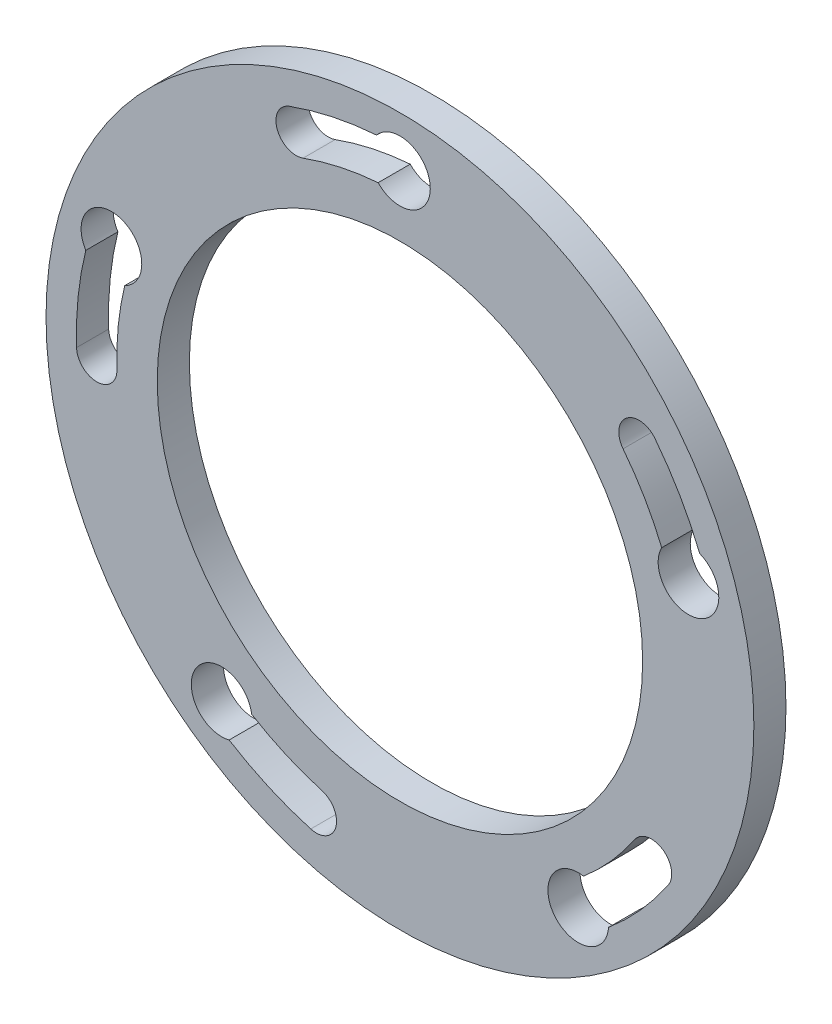
ISO-10303-21;
HEADER;
FILE_DESCRIPTION(('STEP AP214'),'2;1');
FILE_NAME('part.step','',(''),(''),'','','');
FILE_SCHEMA(('AUTOMOTIVE_DESIGN { 1 0 10303 214 1 1 1 1 }'));
ENDSEC;
DATA;
#1=APPLICATION_CONTEXT('core data for automotive mechanical design processes');
#2=APPLICATION_PROTOCOL_DEFINITION('international standard','automotive_design',2000,#1);
#3=PRODUCT_CONTEXT('',#1,'mechanical');
#4=PRODUCT('Part','Part','',(#3));
#5=PRODUCT_RELATED_PRODUCT_CATEGORY('part','',(#4));
#6=PRODUCT_DEFINITION_FORMATION('','',#4);
#7=PRODUCT_DEFINITION_CONTEXT('part definition',#1,'design');
#8=PRODUCT_DEFINITION('design','',#6,#7);
#9=PRODUCT_DEFINITION_SHAPE('','',#8);
#10=(LENGTH_UNIT() NAMED_UNIT(*) SI_UNIT(.MILLI.,.METRE.));
#11=(NAMED_UNIT(*) PLANE_ANGLE_UNIT() SI_UNIT($,.RADIAN.));
#12=(NAMED_UNIT(*) SI_UNIT($,.STERADIAN.) SOLID_ANGLE_UNIT());
#13=UNCERTAINTY_MEASURE_WITH_UNIT(LENGTH_MEASURE(1.E-05),#10,'distance_accuracy_value','');
#14=(GEOMETRIC_REPRESENTATION_CONTEXT(3) GLOBAL_UNCERTAINTY_ASSIGNED_CONTEXT((#13)) GLOBAL_UNIT_ASSIGNED_CONTEXT((#10,
#11,#12)) REPRESENTATION_CONTEXT('',''));
#15=CARTESIAN_POINT('',(0.,0.,0.));
#16=DIRECTION('',(0.,0.,1.));
#17=DIRECTION('',(1.,0.,0.));
#18=AXIS2_PLACEMENT_3D('',#15,#16,#17);
#19=CARTESIAN_POINT('',(0.,0.,3.175));
#20=DIRECTION('',(0.,0.,1.));
#21=DIRECTION('',(1.,0.,0.));
#22=AXIS2_PLACEMENT_3D('',#19,#20,#21);
#23=PLANE('',#22);
#24=CARTESIAN_POINT('',(28.5316954888546,9.27050983124833,3.175));
#25=DIRECTION('',(0.,0.,1.));
#26=DIRECTION('',(1.,0.,0.));
#27=AXIS2_PLACEMENT_3D('',#24,#25,#26);
#28=CIRCLE('',#27,3.00000000000007);
#29=CARTESIAN_POINT('',(25.883271618733,10.6797120893257,3.175));
#30=VERTEX_POINT('',#29);
#31=CARTESIAN_POINT('',(29.641374395643,12.0577329518164,3.175));
#32=VERTEX_POINT('',#31);
#33=EDGE_CURVE('E178',#30,#32,#28,.T.);
#34=ORIENTED_EDGE('',*,*,#33,.F.);
#35=CARTESIAN_POINT('',(0.,0.,3.175));
#36=DIRECTION('',(0.,0.,-1.));
#37=DIRECTION('',(1.,0.,0.));
#38=AXIS2_PLACEMENT_3D('',#35,#36,#37);
#39=CIRCLE('',#38,28.);
#40=CARTESIAN_POINT('',(22.0643011009882,17.2385213091185,3.175));
#41=VERTEX_POINT('',#40);
#42=EDGE_CURVE('E170',#41,#30,#39,.T.);
#43=ORIENTED_EDGE('',*,*,#42,.F.);
#44=CARTESIAN_POINT('',(23.6403226082017,18.4698442597697,3.175));
#45=DIRECTION('',(0.,0.,1.));
#46=DIRECTION('',(1.,0.,0.));
#47=AXIS2_PLACEMENT_3D('',#44,#45,#46);
#48=CIRCLE('',#47,2.);
#49=CARTESIAN_POINT('',(25.2163441154151,19.7011672104211,3.175));
#50=VERTEX_POINT('',#49);
#51=EDGE_CURVE('E193',#50,#41,#48,.T.);
#52=ORIENTED_EDGE('',*,*,#51,.F.);
#53=CARTESIAN_POINT('',(0.,0.,3.175));
#54=DIRECTION('',(0.,0.,1.));
#55=DIRECTION('',(1.,0.,0.));
#56=AXIS2_PLACEMENT_3D('',#53,#54,#55);
#57=CIRCLE('',#56,32.);
#58=EDGE_CURVE('E191',#32,#50,#57,.T.);
#59=ORIENTED_EDGE('',*,*,#58,.F.);
#60=EDGE_LOOP('',(#34,#43,#52,#59));
#61=FACE_BOUND('',#60,.T.);
#62=CARTESIAN_POINT('',(0.,0.,3.175));
#63=DIRECTION('',(0.,0.,1.));
#64=DIRECTION('',(1.,0.,0.));
#65=AXIS2_PLACEMENT_3D('',#62,#63,#64);
#66=CIRCLE('',#65,32.);
#67=CARTESIAN_POINT('',(-16.893018017547,-27.177673599093,3.175));
#68=VERTEX_POINT('',#67);
#69=CARTESIAN_POINT('',(-8.82039538614393,-30.7603742700262,3.175));
#70=VERTEX_POINT('',#69);
#71=EDGE_CURVE('E242',#68,#70,#66,.T.);
#72=ORIENTED_EDGE('',*,*,#71,.F.);
#73=CARTESIAN_POINT('',(-17.6335575687744,-24.2705098312483,3.175));
#74=DIRECTION('',(0.,0.,1.));
#75=DIRECTION('',(1.,0.,0.));
#76=AXIS2_PLACEMENT_3D('',#73,#74,#75);
#77=CIRCLE('',#76,3.0000000000002);
#78=CARTESIAN_POINT('',(-14.6626293447425,-23.8538739138677,3.175));
#79=VERTEX_POINT('',#78);
#80=EDGE_CURVE('E240',#79,#68,#77,.T.);
#81=ORIENTED_EDGE('',*,*,#80,.F.);
#82=CARTESIAN_POINT('',(0.,0.,3.175));
#83=DIRECTION('',(0.,0.,-1.));
#84=DIRECTION('',(1.,0.,0.));
#85=AXIS2_PLACEMENT_3D('',#82,#83,#84);
#86=CIRCLE('',#85,28.);
#87=CARTESIAN_POINT('',(-7.71784596287594,-26.9153274862729,3.175));
#88=VERTEX_POINT('',#87);
#89=EDGE_CURVE('E248',#88,#79,#86,.T.);
#90=ORIENTED_EDGE('',*,*,#89,.F.);
#91=CARTESIAN_POINT('',(-8.26912067451019,-28.8378508781495,3.175));
#92=DIRECTION('',(0.,0.,1.));
#93=DIRECTION('',(1.,0.,0.));
#94=AXIS2_PLACEMENT_3D('',#91,#92,#93);
#95=CIRCLE('',#94,2.);
#96=EDGE_CURVE('E245',#70,#88,#95,.T.);
#97=ORIENTED_EDGE('',*,*,#96,.F.);
#98=EDGE_LOOP('',(#72,#81,#90,#97));
#99=FACE_BOUND('',#98,.T.);
#100=CARTESIAN_POINT('',(0.,0.,3.175));
#101=DIRECTION('',(0.,0.,1.));
#102=DIRECTION('',(1.,0.,0.));
#103=AXIS2_PLACEMENT_3D('',#100,#101,#102);
#104=CIRCLE('',#103,32.);
#105=CARTESIAN_POINT('',(-2.3078970706877,31.9166666666667,3.175));
#106=VERTEX_POINT('',#105);
#107=CARTESIAN_POINT('',(-10.9446445864214,30.0701638651491,3.175));
#108=VERTEX_POINT('',#107);
#109=EDGE_CURVE('E304',#106,#108,#104,.T.);
#110=ORIENTED_EDGE('',*,*,#109,.F.);
#111=CARTESIAN_POINT('',(0.,30.,3.175));
#112=DIRECTION('',(0.,0.,1.));
#113=DIRECTION('',(1.,0.,0.));
#114=AXIS2_PLACEMENT_3D('',#111,#112,#113);
#115=CIRCLE('',#114,3.);
#116=CARTESIAN_POINT('',(-2.1586389744981,27.9166666666667,3.175));
#117=VERTEX_POINT('',#116);
#118=EDGE_CURVE('E302',#117,#106,#115,.T.);
#119=ORIENTED_EDGE('',*,*,#118,.F.);
#120=CARTESIAN_POINT('',(0.,0.,3.175));
#121=DIRECTION('',(0.,0.,-1.));
#122=DIRECTION('',(1.,0.,0.));
#123=AXIS2_PLACEMENT_3D('',#120,#121,#122);
#124=CIRCLE('',#123,28.);
#125=CARTESIAN_POINT('',(-9.57656401311875,26.3113933820054,3.175));
#126=VERTEX_POINT('',#125);
#127=EDGE_CURVE('E310',#126,#117,#124,.T.);
#128=ORIENTED_EDGE('',*,*,#127,.F.);
#129=CARTESIAN_POINT('',(-10.2606042997701,28.1907786235772,3.175));
#130=DIRECTION('',(0.,0.,1.));
#131=DIRECTION('',(1.,0.,0.));
#132=AXIS2_PLACEMENT_3D('',#129,#130,#131);
#133=CIRCLE('',#132,2.);
#134=EDGE_CURVE('E307',#108,#126,#133,.T.);
#135=ORIENTED_EDGE('',*,*,#134,.F.);
#136=EDGE_LOOP('',(#110,#119,#128,#135));
#137=FACE_BOUND('',#136,.T.);
#138=CARTESIAN_POINT('',(0.,0.,3.175));
#139=DIRECTION('',(0.,0.,1.));
#140=DIRECTION('',(1.,0.,0.));
#141=AXIS2_PLACEMENT_3D('',#138,#139,#140);
#142=CIRCLE('',#141,35.);
#143=CARTESIAN_POINT('',(35.,0.,3.175));
#144=VERTEX_POINT('',#143);
#145=EDGE_CURVE('E11',#144,#144,#142,.T.);
#146=ORIENTED_EDGE('',*,*,#145,.T.);
#147=EDGE_LOOP('',(#146));
#148=FACE_BOUND('',#147,.T.);
#149=CARTESIAN_POINT('',(0.,0.,3.175));
#150=DIRECTION('',(0.,0.,1.));
#151=DIRECTION('',(1.,0.,0.));
#152=AXIS2_PLACEMENT_3D('',#149,#150,#151);
#153=CIRCLE('',#152,32.);
#154=CARTESIAN_POINT('',(-31.0677332278643,7.66785185578437,3.175));
#155=VERTEX_POINT('',#154);
#156=CARTESIAN_POINT('',(-31.9805064646111,-1.11678389448004,3.175));
#157=VERTEX_POINT('',#156);
#158=EDGE_CURVE('E273',#155,#157,#153,.T.);
#159=ORIENTED_EDGE('',*,*,#158,.F.);
#160=CARTESIAN_POINT('',(-28.5316954888545,9.27050983124875,3.175));
#161=DIRECTION('',(0.,0.,1.));
#162=DIRECTION('',(1.,0.,0.));
#163=AXIS2_PLACEMENT_3D('',#160,#161,#162);
#164=CIRCLE('',#163,3.00000000000025);
#165=CARTESIAN_POINT('',(-27.2173838744131,6.5737367632755,3.175));
#166=VERTEX_POINT('',#165);
#167=EDGE_CURVE('E271',#166,#155,#164,.T.);
#168=ORIENTED_EDGE('',*,*,#167,.F.);
#169=CARTESIAN_POINT('',(0.,0.,3.175));
#170=DIRECTION('',(0.,0.,-1.));
#171=DIRECTION('',(1.,0.,0.));
#172=AXIS2_PLACEMENT_3D('',#169,#170,#171);
#173=CIRCLE('',#172,28.);
#174=CARTESIAN_POINT('',(-27.9829431565347,-0.977185907670063,3.175));
#175=VERTEX_POINT('',#174);
#176=EDGE_CURVE('E279',#175,#166,#173,.T.);
#177=ORIENTED_EDGE('',*,*,#176,.F.);
#178=CARTESIAN_POINT('',(-29.9817248105729,-1.04698490107472,3.175));
#179=DIRECTION('',(0.,0.,1.));
#180=DIRECTION('',(1.,0.,0.));
#181=AXIS2_PLACEMENT_3D('',#178,#179,#180);
#182=CIRCLE('',#181,2.);
#183=EDGE_CURVE('E276',#157,#175,#182,.T.);
#184=ORIENTED_EDGE('',*,*,#183,.F.);
#185=EDGE_LOOP('',(#159,#168,#177,#184));
#186=FACE_BOUND('',#185,.T.);
#187=CARTESIAN_POINT('',(0.,0.,3.175));
#188=DIRECTION('',(0.,0.,1.));
#189=DIRECTION('',(1.,0.,0.));
#190=AXIS2_PLACEMENT_3D('',#187,#188,#189);
#191=CIRCLE('',#190,32.);
#192=CARTESIAN_POINT('',(20.6272739204559,-24.4645778751745,3.175));
#193=VERTEX_POINT('',#192);
#194=CARTESIAN_POINT('',(26.5292023217614,-17.8941729110639,3.175));
#195=VERTEX_POINT('',#194);
#196=EDGE_CURVE('E211',#193,#195,#191,.T.);
#197=ORIENTED_EDGE('',*,*,#196,.F.);
#198=CARTESIAN_POINT('',(17.6335575687741,-24.2705098312485,3.175));
#199=DIRECTION('',(0.,0.,1.));
#200=DIRECTION('',(1.,0.,0.));
#201=AXIS2_PLACEMENT_3D('',#198,#199,#200);
#202=CIRCLE('',#201,3.00000000000013);
#203=CARTESIAN_POINT('',(18.1553805749206,-21.3162416054002,3.175));
#204=VERTEX_POINT('',#203);
#205=EDGE_CURVE('E209',#204,#193,#202,.T.);
#206=ORIENTED_EDGE('',*,*,#205,.F.);
#207=CARTESIAN_POINT('',(0.,0.,3.175));
#208=DIRECTION('',(0.,0.,-1.));
#209=DIRECTION('',(1.,0.,0.));
#210=AXIS2_PLACEMENT_3D('',#207,#208,#209);
#211=CIRCLE('',#210,28.);
#212=CARTESIAN_POINT('',(23.2130520315412,-15.6574012971809,3.175));
#213=VERTEX_POINT('',#212);
#214=EDGE_CURVE('E217',#213,#204,#211,.T.);
#215=ORIENTED_EDGE('',*,*,#214,.F.);
#216=CARTESIAN_POINT('',(24.8711271766512,-16.7757871041225,3.175));
#217=DIRECTION('',(0.,0.,1.));
#218=DIRECTION('',(1.,0.,0.));
#219=AXIS2_PLACEMENT_3D('',#216,#217,#218);
#220=CIRCLE('',#219,1.99999999999999);
#221=EDGE_CURVE('E214',#195,#213,#220,.T.);
#222=ORIENTED_EDGE('',*,*,#221,.F.);
#223=EDGE_LOOP('',(#197,#206,#215,#222));
#224=FACE_BOUND('',#223,.T.);
#225=CARTESIAN_POINT('',(0.,0.,3.175));
#226=DIRECTION('',(0.,0.,1.));
#227=DIRECTION('',(1.,0.,0.));
#228=AXIS2_PLACEMENT_3D('',#225,#226,#227);
#229=CIRCLE('',#228,24.);
#230=CARTESIAN_POINT('',(24.,0.,3.175));
#231=VERTEX_POINT('',#230);
#232=EDGE_CURVE('E199',#231,#231,#229,.T.);
#233=ORIENTED_EDGE('',*,*,#232,.F.);
#234=EDGE_LOOP('',(#233));
#235=FACE_BOUND('',#234,.T.);
#236=ADVANCED_FACE('F33',(#61,#99,#137,#148,#186,#224,#235),#23,.T.);
#237=CARTESIAN_POINT('',(0.,0.,0.));
#238=DIRECTION('',(0.,0.,1.));
#239=DIRECTION('',(1.,0.,0.));
#240=AXIS2_PLACEMENT_3D('',#237,#238,#239);
#241=PLANE('',#240);
#242=CARTESIAN_POINT('',(0.,0.,0.));
#243=DIRECTION('',(0.,0.,-1.));
#244=DIRECTION('',(1.,0.,0.));
#245=AXIS2_PLACEMENT_3D('',#242,#243,#244);
#246=CIRCLE('',#245,28.);
#247=CARTESIAN_POINT('',(22.0643011009882,17.2385213091185,0.));
#248=VERTEX_POINT('',#247);
#249=CARTESIAN_POINT('',(25.883271618733,10.6797120893257,0.));
#250=VERTEX_POINT('',#249);
#251=EDGE_CURVE('E56',#248,#250,#246,.T.);
#252=ORIENTED_EDGE('',*,*,#251,.T.);
#253=CARTESIAN_POINT('',(28.5316954888546,9.27050983124833,0.));
#254=DIRECTION('',(0.,0.,1.));
#255=DIRECTION('',(1.,0.,0.));
#256=AXIS2_PLACEMENT_3D('',#253,#254,#255);
#257=CIRCLE('',#256,3.00000000000007);
#258=CARTESIAN_POINT('',(29.641374395643,12.0577329518164,0.));
#259=VERTEX_POINT('',#258);
#260=EDGE_CURVE('E185',#250,#259,#257,.T.);
#261=ORIENTED_EDGE('',*,*,#260,.T.);
#262=CARTESIAN_POINT('',(0.,0.,0.));
#263=DIRECTION('',(0.,0.,1.));
#264=DIRECTION('',(1.,0.,0.));
#265=AXIS2_PLACEMENT_3D('',#262,#263,#264);
#266=CIRCLE('',#265,32.);
#267=CARTESIAN_POINT('',(25.2163441154151,19.7011672104211,0.));
#268=VERTEX_POINT('',#267);
#269=EDGE_CURVE('E201',#259,#268,#266,.T.);
#270=ORIENTED_EDGE('',*,*,#269,.T.);
#271=CARTESIAN_POINT('',(23.6403226082017,18.4698442597697,0.));
#272=DIRECTION('',(0.,0.,1.));
#273=DIRECTION('',(1.,0.,0.));
#274=AXIS2_PLACEMENT_3D('',#271,#272,#273);
#275=CIRCLE('',#274,2.);
#276=EDGE_CURVE('E179',#268,#248,#275,.T.);
#277=ORIENTED_EDGE('',*,*,#276,.T.);
#278=EDGE_LOOP('',(#252,#261,#270,#277));
#279=FACE_BOUND('',#278,.T.);
#280=CARTESIAN_POINT('',(-17.6335575687744,-24.2705098312483,0.));
#281=DIRECTION('',(0.,0.,1.));
#282=DIRECTION('',(1.,0.,0.));
#283=AXIS2_PLACEMENT_3D('',#280,#281,#282);
#284=CIRCLE('',#283,3.0000000000002);
#285=CARTESIAN_POINT('',(-14.6626293447425,-23.8538739138677,0.));
#286=VERTEX_POINT('',#285);
#287=CARTESIAN_POINT('',(-16.893018017547,-27.177673599093,0.));
#288=VERTEX_POINT('',#287);
#289=EDGE_CURVE('E239',#286,#288,#284,.T.);
#290=ORIENTED_EDGE('',*,*,#289,.T.);
#291=CARTESIAN_POINT('',(0.,0.,0.));
#292=DIRECTION('',(0.,0.,1.));
#293=DIRECTION('',(1.,0.,0.));
#294=AXIS2_PLACEMENT_3D('',#291,#292,#293);
#295=CIRCLE('',#294,32.);
#296=CARTESIAN_POINT('',(-8.82039538614393,-30.7603742700262,0.));
#297=VERTEX_POINT('',#296);
#298=EDGE_CURVE('E253',#288,#297,#295,.T.);
#299=ORIENTED_EDGE('',*,*,#298,.T.);
#300=CARTESIAN_POINT('',(-8.26912067451019,-28.8378508781495,0.));
#301=DIRECTION('',(0.,0.,1.));
#302=DIRECTION('',(1.,0.,0.));
#303=AXIS2_PLACEMENT_3D('',#300,#301,#302);
#304=CIRCLE('',#303,2.);
#305=CARTESIAN_POINT('',(-7.71784596287594,-26.9153274862729,0.));
#306=VERTEX_POINT('',#305);
#307=EDGE_CURVE('E256',#297,#306,#304,.T.);
#308=ORIENTED_EDGE('',*,*,#307,.T.);
#309=CARTESIAN_POINT('',(0.,0.,0.));
#310=DIRECTION('',(0.,0.,-1.));
#311=DIRECTION('',(1.,0.,0.));
#312=AXIS2_PLACEMENT_3D('',#309,#310,#311);
#313=CIRCLE('',#312,28.);
#314=EDGE_CURVE('E243',#306,#286,#313,.T.);
#315=ORIENTED_EDGE('',*,*,#314,.T.);
#316=EDGE_LOOP('',(#290,#299,#308,#315));
#317=FACE_BOUND('',#316,.T.);
#318=CARTESIAN_POINT('',(0.,30.,0.));
#319=DIRECTION('',(0.,0.,1.));
#320=DIRECTION('',(1.,0.,0.));
#321=AXIS2_PLACEMENT_3D('',#318,#319,#320);
#322=CIRCLE('',#321,3.);
#323=CARTESIAN_POINT('',(-2.1586389744981,27.9166666666667,0.));
#324=VERTEX_POINT('',#323);
#325=CARTESIAN_POINT('',(-2.3078970706877,31.9166666666667,0.));
#326=VERTEX_POINT('',#325);
#327=EDGE_CURVE('E301',#324,#326,#322,.T.);
#328=ORIENTED_EDGE('',*,*,#327,.T.);
#329=CARTESIAN_POINT('',(0.,0.,0.));
#330=DIRECTION('',(0.,0.,1.));
#331=DIRECTION('',(1.,0.,0.));
#332=AXIS2_PLACEMENT_3D('',#329,#330,#331);
#333=CIRCLE('',#332,32.);
#334=CARTESIAN_POINT('',(-10.9446445864214,30.0701638651491,0.));
#335=VERTEX_POINT('',#334);
#336=EDGE_CURVE('E315',#326,#335,#333,.T.);
#337=ORIENTED_EDGE('',*,*,#336,.T.);
#338=CARTESIAN_POINT('',(-10.2606042997701,28.1907786235772,0.));
#339=DIRECTION('',(0.,0.,1.));
#340=DIRECTION('',(1.,0.,0.));
#341=AXIS2_PLACEMENT_3D('',#338,#339,#340);
#342=CIRCLE('',#341,2.);
#343=CARTESIAN_POINT('',(-9.57656401311875,26.3113933820054,0.));
#344=VERTEX_POINT('',#343);
#345=EDGE_CURVE('E318',#335,#344,#342,.T.);
#346=ORIENTED_EDGE('',*,*,#345,.T.);
#347=CARTESIAN_POINT('',(0.,0.,0.));
#348=DIRECTION('',(0.,0.,-1.));
#349=DIRECTION('',(1.,0.,0.));
#350=AXIS2_PLACEMENT_3D('',#347,#348,#349);
#351=CIRCLE('',#350,28.);
#352=EDGE_CURVE('E305',#344,#324,#351,.T.);
#353=ORIENTED_EDGE('',*,*,#352,.T.);
#354=EDGE_LOOP('',(#328,#337,#346,#353));
#355=FACE_BOUND('',#354,.T.);
#356=CARTESIAN_POINT('',(0.,0.,0.));
#357=DIRECTION('',(0.,0.,1.));
#358=DIRECTION('',(1.,0.,0.));
#359=AXIS2_PLACEMENT_3D('',#356,#357,#358);
#360=CIRCLE('',#359,35.);
#361=CARTESIAN_POINT('',(35.,0.,0.));
#362=VERTEX_POINT('',#361);
#363=EDGE_CURVE('E37',#362,#362,#360,.T.);
#364=ORIENTED_EDGE('',*,*,#363,.F.);
#365=EDGE_LOOP('',(#364));
#366=FACE_BOUND('',#365,.T.);
#367=CARTESIAN_POINT('',(-28.5316954888545,9.27050983124875,0.));
#368=DIRECTION('',(0.,0.,1.));
#369=DIRECTION('',(1.,0.,0.));
#370=AXIS2_PLACEMENT_3D('',#367,#368,#369);
#371=CIRCLE('',#370,3.00000000000025);
#372=CARTESIAN_POINT('',(-27.2173838744131,6.5737367632755,0.));
#373=VERTEX_POINT('',#372);
#374=CARTESIAN_POINT('',(-31.0677332278643,7.66785185578437,0.));
#375=VERTEX_POINT('',#374);
#376=EDGE_CURVE('E270',#373,#375,#371,.T.);
#377=ORIENTED_EDGE('',*,*,#376,.T.);
#378=CARTESIAN_POINT('',(0.,0.,0.));
#379=DIRECTION('',(0.,0.,1.));
#380=DIRECTION('',(1.,0.,0.));
#381=AXIS2_PLACEMENT_3D('',#378,#379,#380);
#382=CIRCLE('',#381,32.);
#383=CARTESIAN_POINT('',(-31.9805064646111,-1.11678389448004,0.));
#384=VERTEX_POINT('',#383);
#385=EDGE_CURVE('E284',#375,#384,#382,.T.);
#386=ORIENTED_EDGE('',*,*,#385,.T.);
#387=CARTESIAN_POINT('',(-29.9817248105729,-1.04698490107472,0.));
#388=DIRECTION('',(0.,0.,1.));
#389=DIRECTION('',(1.,0.,0.));
#390=AXIS2_PLACEMENT_3D('',#387,#388,#389);
#391=CIRCLE('',#390,2.);
#392=CARTESIAN_POINT('',(-27.9829431565347,-0.977185907670063,0.));
#393=VERTEX_POINT('',#392);
#394=EDGE_CURVE('E287',#384,#393,#391,.T.);
#395=ORIENTED_EDGE('',*,*,#394,.T.);
#396=CARTESIAN_POINT('',(0.,0.,0.));
#397=DIRECTION('',(0.,0.,-1.));
#398=DIRECTION('',(1.,0.,0.));
#399=AXIS2_PLACEMENT_3D('',#396,#397,#398);
#400=CIRCLE('',#399,28.);
#401=EDGE_CURVE('E274',#393,#373,#400,.T.);
#402=ORIENTED_EDGE('',*,*,#401,.T.);
#403=EDGE_LOOP('',(#377,#386,#395,#402));
#404=FACE_BOUND('',#403,.T.);
#405=CARTESIAN_POINT('',(17.6335575687741,-24.2705098312485,0.));
#406=DIRECTION('',(0.,0.,1.));
#407=DIRECTION('',(1.,0.,0.));
#408=AXIS2_PLACEMENT_3D('',#405,#406,#407);
#409=CIRCLE('',#408,3.00000000000013);
#410=CARTESIAN_POINT('',(18.1553805749206,-21.3162416054002,0.));
#411=VERTEX_POINT('',#410);
#412=CARTESIAN_POINT('',(20.6272739204559,-24.4645778751745,0.));
#413=VERTEX_POINT('',#412);
#414=EDGE_CURVE('E186',#411,#413,#409,.T.);
#415=ORIENTED_EDGE('',*,*,#414,.T.);
#416=CARTESIAN_POINT('',(0.,0.,0.));
#417=DIRECTION('',(0.,0.,1.));
#418=DIRECTION('',(1.,0.,0.));
#419=AXIS2_PLACEMENT_3D('',#416,#417,#418);
#420=CIRCLE('',#419,32.);
#421=CARTESIAN_POINT('',(26.5292023217614,-17.8941729110639,0.));
#422=VERTEX_POINT('',#421);
#423=EDGE_CURVE('E222',#413,#422,#420,.T.);
#424=ORIENTED_EDGE('',*,*,#423,.T.);
#425=CARTESIAN_POINT('',(24.8711271766512,-16.7757871041225,0.));
#426=DIRECTION('',(0.,0.,1.));
#427=DIRECTION('',(1.,0.,0.));
#428=AXIS2_PLACEMENT_3D('',#425,#426,#427);
#429=CIRCLE('',#428,1.99999999999999);
#430=CARTESIAN_POINT('',(23.2130520315412,-15.6574012971809,0.));
#431=VERTEX_POINT('',#430);
#432=EDGE_CURVE('E225',#422,#431,#429,.T.);
#433=ORIENTED_EDGE('',*,*,#432,.T.);
#434=CARTESIAN_POINT('',(0.,0.,0.));
#435=DIRECTION('',(0.,0.,-1.));
#436=DIRECTION('',(1.,0.,0.));
#437=AXIS2_PLACEMENT_3D('',#434,#435,#436);
#438=CIRCLE('',#437,28.);
#439=EDGE_CURVE('E212',#431,#411,#438,.T.);
#440=ORIENTED_EDGE('',*,*,#439,.T.);
#441=EDGE_LOOP('',(#415,#424,#433,#440));
#442=FACE_BOUND('',#441,.T.);
#443=CARTESIAN_POINT('',(0.,0.,0.));
#444=DIRECTION('',(0.,0.,1.));
#445=DIRECTION('',(1.,0.,0.));
#446=AXIS2_PLACEMENT_3D('',#443,#444,#445);
#447=CIRCLE('',#446,24.);
#448=CARTESIAN_POINT('',(24.,0.,0.));
#449=VERTEX_POINT('',#448);
#450=EDGE_CURVE('E345',#449,#449,#447,.T.);
#451=ORIENTED_EDGE('',*,*,#450,.T.);
#452=EDGE_LOOP('',(#451));
#453=FACE_BOUND('',#452,.T.);
#454=ADVANCED_FACE('F337',(#279,#317,#355,#366,#404,#442,#453),#241,.F.);
#455=CARTESIAN_POINT('',(0.,0.,3.175));
#456=DIRECTION('',(0.,0.,-1.));
#457=DIRECTION('',(-1.,0.,0.));
#458=AXIS2_PLACEMENT_3D('',#455,#456,#457);
#459=CYLINDRICAL_SURFACE('',#458,35.);
#460=ORIENTED_EDGE('',*,*,#145,.F.);
#461=EDGE_LOOP('',(#460));
#462=FACE_BOUND('',#461,.T.);
#463=ORIENTED_EDGE('',*,*,#363,.T.);
#464=EDGE_LOOP('',(#463));
#465=FACE_BOUND('',#464,.T.);
#466=ADVANCED_FACE('F35',(#462,#465),#459,.T.);
#467=CARTESIAN_POINT('',(0.,30.,3.175));
#468=DIRECTION('',(0.,0.,-1.));
#469=DIRECTION('',(-1.,0.,0.));
#470=AXIS2_PLACEMENT_3D('',#467,#468,#469);
#471=CYLINDRICAL_SURFACE('',#470,3.);
#472=ORIENTED_EDGE('',*,*,#327,.F.);
#473=DIRECTION('',(0.,0.,-1.));
#474=VECTOR('',#473,1.);
#475=CARTESIAN_POINT('',(-2.1586389744981,27.9166666666667,3.175));
#476=LINE('',#475,#474);
#477=EDGE_CURVE('E312',#117,#324,#476,.T.);
#478=ORIENTED_EDGE('',*,*,#477,.F.);
#479=ORIENTED_EDGE('',*,*,#118,.T.);
#480=DIRECTION('',(0.,0.,-1.));
#481=VECTOR('',#480,1.);
#482=CARTESIAN_POINT('',(-2.3078970706877,31.9166666666667,3.175));
#483=LINE('',#482,#481);
#484=EDGE_CURVE('E329',#106,#326,#483,.T.);
#485=ORIENTED_EDGE('',*,*,#484,.T.);
#486=EDGE_LOOP('',(#472,#478,#479,#485));
#487=FACE_BOUND('',#486,.T.);
#488=ADVANCED_FACE('F358',(#487),#471,.F.);
#489=CARTESIAN_POINT('',(0.,0.,3.175));
#490=DIRECTION('',(0.,0.,-1.));
#491=DIRECTION('',(-1.,0.,0.));
#492=AXIS2_PLACEMENT_3D('',#489,#490,#491);
#493=CYLINDRICAL_SURFACE('',#492,32.);
#494=ORIENTED_EDGE('',*,*,#336,.F.);
#495=ORIENTED_EDGE('',*,*,#484,.F.);
#496=ORIENTED_EDGE('',*,*,#109,.T.);
#497=DIRECTION('',(0.,0.,-1.));
#498=VECTOR('',#497,1.);
#499=CARTESIAN_POINT('',(-10.9446445864214,30.0701638651491,3.175));
#500=LINE('',#499,#498);
#501=EDGE_CURVE('E327',#108,#335,#500,.T.);
#502=ORIENTED_EDGE('',*,*,#501,.T.);
#503=EDGE_LOOP('',(#494,#495,#496,#502));
#504=FACE_BOUND('',#503,.T.);
#505=ADVANCED_FACE('F361',(#504),#493,.F.);
#506=CARTESIAN_POINT('',(-10.2606042997701,28.1907786235772,3.175));
#507=DIRECTION('',(0.,0.,-1.));
#508=DIRECTION('',(-1.,0.,0.));
#509=AXIS2_PLACEMENT_3D('',#506,#507,#508);
#510=CYLINDRICAL_SURFACE('',#509,2.);
#511=ORIENTED_EDGE('',*,*,#345,.F.);
#512=ORIENTED_EDGE('',*,*,#501,.F.);
#513=ORIENTED_EDGE('',*,*,#134,.T.);
#514=DIRECTION('',(0.,0.,-1.));
#515=VECTOR('',#514,1.);
#516=CARTESIAN_POINT('',(-9.57656401311875,26.3113933820054,3.175));
#517=LINE('',#516,#515);
#518=EDGE_CURVE('E325',#126,#344,#517,.T.);
#519=ORIENTED_EDGE('',*,*,#518,.T.);
#520=EDGE_LOOP('',(#511,#512,#513,#519));
#521=FACE_BOUND('',#520,.T.);
#522=ADVANCED_FACE('F364',(#521),#510,.F.);
#523=CARTESIAN_POINT('',(0.,0.,3.175));
#524=DIRECTION('',(0.,0.,-1.));
#525=DIRECTION('',(-1.,0.,0.));
#526=AXIS2_PLACEMENT_3D('',#523,#524,#525);
#527=CYLINDRICAL_SURFACE('',#526,28.);
#528=ORIENTED_EDGE('',*,*,#352,.F.);
#529=ORIENTED_EDGE('',*,*,#518,.F.);
#530=ORIENTED_EDGE('',*,*,#127,.T.);
#531=ORIENTED_EDGE('',*,*,#477,.T.);
#532=EDGE_LOOP('',(#528,#529,#530,#531));
#533=FACE_BOUND('',#532,.T.);
#534=ADVANCED_FACE('F368',(#533),#527,.T.);
#535=CARTESIAN_POINT('',(-28.5316954888545,9.27050983124875,3.175));
#536=DIRECTION('',(0.,0.,-1.));
#537=DIRECTION('',(-1.,0.,0.));
#538=AXIS2_PLACEMENT_3D('',#535,#536,#537);
#539=CYLINDRICAL_SURFACE('',#538,3.00000000000025);
#540=ORIENTED_EDGE('',*,*,#376,.F.);
#541=DIRECTION('',(0.,0.,-1.));
#542=VECTOR('',#541,1.);
#543=CARTESIAN_POINT('',(-27.2173838744131,6.5737367632755,3.175));
#544=LINE('',#543,#542);
#545=EDGE_CURVE('E281',#166,#373,#544,.T.);
#546=ORIENTED_EDGE('',*,*,#545,.F.);
#547=ORIENTED_EDGE('',*,*,#167,.T.);
#548=DIRECTION('',(0.,0.,-1.));
#549=VECTOR('',#548,1.);
#550=CARTESIAN_POINT('',(-31.0677332278643,7.66785185578437,3.175));
#551=LINE('',#550,#549);
#552=EDGE_CURVE('E298',#155,#375,#551,.T.);
#553=ORIENTED_EDGE('',*,*,#552,.T.);
#554=EDGE_LOOP('',(#540,#546,#547,#553));
#555=FACE_BOUND('',#554,.T.);
#556=ADVANCED_FACE('F372',(#555),#539,.F.);
#557=CARTESIAN_POINT('',(0.,0.,3.175));
#558=DIRECTION('',(0.,0.,-1.));
#559=DIRECTION('',(-1.,0.,0.));
#560=AXIS2_PLACEMENT_3D('',#557,#558,#559);
#561=CYLINDRICAL_SURFACE('',#560,32.);
#562=ORIENTED_EDGE('',*,*,#385,.F.);
#563=ORIENTED_EDGE('',*,*,#552,.F.);
#564=ORIENTED_EDGE('',*,*,#158,.T.);
#565=DIRECTION('',(0.,0.,-1.));
#566=VECTOR('',#565,1.);
#567=CARTESIAN_POINT('',(-31.9805064646111,-1.11678389448004,3.175));
#568=LINE('',#567,#566);
#569=EDGE_CURVE('E296',#157,#384,#568,.T.);
#570=ORIENTED_EDGE('',*,*,#569,.T.);
#571=EDGE_LOOP('',(#562,#563,#564,#570));
#572=FACE_BOUND('',#571,.T.);
#573=ADVANCED_FACE('F376',(#572),#561,.F.);
#574=CARTESIAN_POINT('',(-29.9817248105729,-1.04698490107472,3.175));
#575=DIRECTION('',(0.,0.,-1.));
#576=DIRECTION('',(-1.,0.,0.));
#577=AXIS2_PLACEMENT_3D('',#574,#575,#576);
#578=CYLINDRICAL_SURFACE('',#577,2.);
#579=ORIENTED_EDGE('',*,*,#394,.F.);
#580=ORIENTED_EDGE('',*,*,#569,.F.);
#581=ORIENTED_EDGE('',*,*,#183,.T.);
#582=DIRECTION('',(0.,0.,-1.));
#583=VECTOR('',#582,1.);
#584=CARTESIAN_POINT('',(-27.9829431565347,-0.977185907670063,3.175));
#585=LINE('',#584,#583);
#586=EDGE_CURVE('E294',#175,#393,#585,.T.);
#587=ORIENTED_EDGE('',*,*,#586,.T.);
#588=EDGE_LOOP('',(#579,#580,#581,#587));
#589=FACE_BOUND('',#588,.T.);
#590=ADVANCED_FACE('F380',(#589),#578,.F.);
#591=CARTESIAN_POINT('',(0.,0.,3.175));
#592=DIRECTION('',(0.,0.,-1.));
#593=DIRECTION('',(-1.,0.,0.));
#594=AXIS2_PLACEMENT_3D('',#591,#592,#593);
#595=CYLINDRICAL_SURFACE('',#594,28.);
#596=ORIENTED_EDGE('',*,*,#401,.F.);
#597=ORIENTED_EDGE('',*,*,#586,.F.);
#598=ORIENTED_EDGE('',*,*,#176,.T.);
#599=ORIENTED_EDGE('',*,*,#545,.T.);
#600=EDGE_LOOP('',(#596,#597,#598,#599));
#601=FACE_BOUND('',#600,.T.);
#602=ADVANCED_FACE('F384',(#601),#595,.T.);
#603=CARTESIAN_POINT('',(-17.6335575687744,-24.2705098312483,3.175));
#604=DIRECTION('',(0.,0.,-1.));
#605=DIRECTION('',(-1.,0.,0.));
#606=AXIS2_PLACEMENT_3D('',#603,#604,#605);
#607=CYLINDRICAL_SURFACE('',#606,3.0000000000002);
#608=ORIENTED_EDGE('',*,*,#289,.F.);
#609=DIRECTION('',(0.,0.,-1.));
#610=VECTOR('',#609,1.);
#611=CARTESIAN_POINT('',(-14.6626293447425,-23.8538739138677,3.175));
#612=LINE('',#611,#610);
#613=EDGE_CURVE('E250',#79,#286,#612,.T.);
#614=ORIENTED_EDGE('',*,*,#613,.F.);
#615=ORIENTED_EDGE('',*,*,#80,.T.);
#616=DIRECTION('',(0.,0.,-1.));
#617=VECTOR('',#616,1.);
#618=CARTESIAN_POINT('',(-16.893018017547,-27.177673599093,3.175));
#619=LINE('',#618,#617);
#620=EDGE_CURVE('E267',#68,#288,#619,.T.);
#621=ORIENTED_EDGE('',*,*,#620,.T.);
#622=EDGE_LOOP('',(#608,#614,#615,#621));
#623=FACE_BOUND('',#622,.T.);
#624=ADVANCED_FACE('F388',(#623),#607,.F.);
#625=CARTESIAN_POINT('',(0.,0.,3.175));
#626=DIRECTION('',(0.,0.,-1.));
#627=DIRECTION('',(-1.,0.,0.));
#628=AXIS2_PLACEMENT_3D('',#625,#626,#627);
#629=CYLINDRICAL_SURFACE('',#628,32.);
#630=ORIENTED_EDGE('',*,*,#298,.F.);
#631=ORIENTED_EDGE('',*,*,#620,.F.);
#632=ORIENTED_EDGE('',*,*,#71,.T.);
#633=DIRECTION('',(0.,0.,-1.));
#634=VECTOR('',#633,1.);
#635=CARTESIAN_POINT('',(-8.82039538614393,-30.7603742700262,3.175));
#636=LINE('',#635,#634);
#637=EDGE_CURVE('E265',#70,#297,#636,.T.);
#638=ORIENTED_EDGE('',*,*,#637,.T.);
#639=EDGE_LOOP('',(#630,#631,#632,#638));
#640=FACE_BOUND('',#639,.T.);
#641=ADVANCED_FACE('F392',(#640),#629,.F.);
#642=CARTESIAN_POINT('',(-8.26912067451019,-28.8378508781495,3.175));
#643=DIRECTION('',(0.,0.,-1.));
#644=DIRECTION('',(-1.,0.,0.));
#645=AXIS2_PLACEMENT_3D('',#642,#643,#644);
#646=CYLINDRICAL_SURFACE('',#645,2.);
#647=ORIENTED_EDGE('',*,*,#307,.F.);
#648=ORIENTED_EDGE('',*,*,#637,.F.);
#649=ORIENTED_EDGE('',*,*,#96,.T.);
#650=DIRECTION('',(0.,0.,-1.));
#651=VECTOR('',#650,1.);
#652=CARTESIAN_POINT('',(-7.71784596287594,-26.9153274862729,3.175));
#653=LINE('',#652,#651);
#654=EDGE_CURVE('E263',#88,#306,#653,.T.);
#655=ORIENTED_EDGE('',*,*,#654,.T.);
#656=EDGE_LOOP('',(#647,#648,#649,#655));
#657=FACE_BOUND('',#656,.T.);
#658=ADVANCED_FACE('F396',(#657),#646,.F.);
#659=CARTESIAN_POINT('',(0.,0.,3.175));
#660=DIRECTION('',(0.,0.,-1.));
#661=DIRECTION('',(-1.,0.,0.));
#662=AXIS2_PLACEMENT_3D('',#659,#660,#661);
#663=CYLINDRICAL_SURFACE('',#662,28.);
#664=ORIENTED_EDGE('',*,*,#314,.F.);
#665=ORIENTED_EDGE('',*,*,#654,.F.);
#666=ORIENTED_EDGE('',*,*,#89,.T.);
#667=ORIENTED_EDGE('',*,*,#613,.T.);
#668=EDGE_LOOP('',(#664,#665,#666,#667));
#669=FACE_BOUND('',#668,.T.);
#670=ADVANCED_FACE('F400',(#669),#663,.T.);
#671=CARTESIAN_POINT('',(17.6335575687741,-24.2705098312485,3.175));
#672=DIRECTION('',(0.,0.,-1.));
#673=DIRECTION('',(-1.,0.,0.));
#674=AXIS2_PLACEMENT_3D('',#671,#672,#673);
#675=CYLINDRICAL_SURFACE('',#674,3.00000000000013);
#676=ORIENTED_EDGE('',*,*,#414,.F.);
#677=DIRECTION('',(0.,0.,-1.));
#678=VECTOR('',#677,1.);
#679=CARTESIAN_POINT('',(18.1553805749206,-21.3162416054002,3.175));
#680=LINE('',#679,#678);
#681=EDGE_CURVE('E219',#204,#411,#680,.T.);
#682=ORIENTED_EDGE('',*,*,#681,.F.);
#683=ORIENTED_EDGE('',*,*,#205,.T.);
#684=DIRECTION('',(0.,0.,-1.));
#685=VECTOR('',#684,1.);
#686=CARTESIAN_POINT('',(20.6272739204559,-24.4645778751745,3.175));
#687=LINE('',#686,#685);
#688=EDGE_CURVE('E236',#193,#413,#687,.T.);
#689=ORIENTED_EDGE('',*,*,#688,.T.);
#690=EDGE_LOOP('',(#676,#682,#683,#689));
#691=FACE_BOUND('',#690,.T.);
#692=ADVANCED_FACE('F404',(#691),#675,.F.);
#693=CARTESIAN_POINT('',(0.,0.,3.175));
#694=DIRECTION('',(0.,0.,-1.));
#695=DIRECTION('',(-1.,0.,0.));
#696=AXIS2_PLACEMENT_3D('',#693,#694,#695);
#697=CYLINDRICAL_SURFACE('',#696,32.);
#698=ORIENTED_EDGE('',*,*,#423,.F.);
#699=ORIENTED_EDGE('',*,*,#688,.F.);
#700=ORIENTED_EDGE('',*,*,#196,.T.);
#701=DIRECTION('',(0.,0.,-1.));
#702=VECTOR('',#701,1.);
#703=CARTESIAN_POINT('',(26.5292023217614,-17.8941729110639,3.175));
#704=LINE('',#703,#702);
#705=EDGE_CURVE('E234',#195,#422,#704,.T.);
#706=ORIENTED_EDGE('',*,*,#705,.T.);
#707=EDGE_LOOP('',(#698,#699,#700,#706));
#708=FACE_BOUND('',#707,.T.);
#709=ADVANCED_FACE('F408',(#708),#697,.F.);
#710=CARTESIAN_POINT('',(24.8711271766512,-16.7757871041225,3.175));
#711=DIRECTION('',(0.,0.,-1.));
#712=DIRECTION('',(-1.,0.,0.));
#713=AXIS2_PLACEMENT_3D('',#710,#711,#712);
#714=CYLINDRICAL_SURFACE('',#713,1.99999999999999);
#715=ORIENTED_EDGE('',*,*,#432,.F.);
#716=ORIENTED_EDGE('',*,*,#705,.F.);
#717=ORIENTED_EDGE('',*,*,#221,.T.);
#718=DIRECTION('',(0.,0.,-1.));
#719=VECTOR('',#718,1.);
#720=CARTESIAN_POINT('',(23.2130520315412,-15.6574012971809,3.175));
#721=LINE('',#720,#719);
#722=EDGE_CURVE('E232',#213,#431,#721,.T.);
#723=ORIENTED_EDGE('',*,*,#722,.T.);
#724=EDGE_LOOP('',(#715,#716,#717,#723));
#725=FACE_BOUND('',#724,.T.);
#726=ADVANCED_FACE('F412',(#725),#714,.F.);
#727=CARTESIAN_POINT('',(0.,0.,3.175));
#728=DIRECTION('',(0.,0.,-1.));
#729=DIRECTION('',(-1.,0.,0.));
#730=AXIS2_PLACEMENT_3D('',#727,#728,#729);
#731=CYLINDRICAL_SURFACE('',#730,28.);
#732=ORIENTED_EDGE('',*,*,#439,.F.);
#733=ORIENTED_EDGE('',*,*,#722,.F.);
#734=ORIENTED_EDGE('',*,*,#214,.T.);
#735=ORIENTED_EDGE('',*,*,#681,.T.);
#736=EDGE_LOOP('',(#732,#733,#734,#735));
#737=FACE_BOUND('',#736,.T.);
#738=ADVANCED_FACE('F416',(#737),#731,.T.);
#739=CARTESIAN_POINT('',(0.,0.,3.175));
#740=DIRECTION('',(0.,0.,-1.));
#741=DIRECTION('',(-1.,0.,0.));
#742=AXIS2_PLACEMENT_3D('',#739,#740,#741);
#743=CYLINDRICAL_SURFACE('',#742,28.);
#744=ORIENTED_EDGE('',*,*,#251,.F.);
#745=DIRECTION('',(0.,0.,-1.));
#746=VECTOR('',#745,1.);
#747=CARTESIAN_POINT('',(22.0643011009882,17.2385213091185,3.175));
#748=LINE('',#747,#746);
#749=EDGE_CURVE('E174',#41,#248,#748,.T.);
#750=ORIENTED_EDGE('',*,*,#749,.F.);
#751=ORIENTED_EDGE('',*,*,#42,.T.);
#752=DIRECTION('',(0.,0.,-1.));
#753=VECTOR('',#752,1.);
#754=CARTESIAN_POINT('',(25.883271618733,10.6797120893257,3.175));
#755=LINE('',#754,#753);
#756=EDGE_CURVE('E173',#30,#250,#755,.T.);
#757=ORIENTED_EDGE('',*,*,#756,.T.);
#758=EDGE_LOOP('',(#744,#750,#751,#757));
#759=FACE_BOUND('',#758,.T.);
#760=ADVANCED_FACE('F172',(#759),#743,.T.);
#761=CARTESIAN_POINT('',(28.5316954888546,9.27050983124833,3.175));
#762=DIRECTION('',(0.,0.,-1.));
#763=DIRECTION('',(-1.,0.,0.));
#764=AXIS2_PLACEMENT_3D('',#761,#762,#763);
#765=CYLINDRICAL_SURFACE('',#764,3.00000000000007);
#766=ORIENTED_EDGE('',*,*,#260,.F.);
#767=ORIENTED_EDGE('',*,*,#756,.F.);
#768=ORIENTED_EDGE('',*,*,#33,.T.);
#769=DIRECTION('',(0.,0.,-1.));
#770=VECTOR('',#769,1.);
#771=CARTESIAN_POINT('',(29.641374395643,12.0577329518164,3.175));
#772=LINE('',#771,#770);
#773=EDGE_CURVE('E187',#32,#259,#772,.T.);
#774=ORIENTED_EDGE('',*,*,#773,.T.);
#775=EDGE_LOOP('',(#766,#767,#768,#774));
#776=FACE_BOUND('',#775,.T.);
#777=ADVANCED_FACE('F182',(#776),#765,.F.);
#778=CARTESIAN_POINT('',(0.,0.,3.175));
#779=DIRECTION('',(0.,0.,-1.));
#780=DIRECTION('',(-1.,0.,0.));
#781=AXIS2_PLACEMENT_3D('',#778,#779,#780);
#782=CYLINDRICAL_SURFACE('',#781,32.);
#783=ORIENTED_EDGE('',*,*,#269,.F.);
#784=ORIENTED_EDGE('',*,*,#773,.F.);
#785=ORIENTED_EDGE('',*,*,#58,.T.);
#786=DIRECTION('',(0.,0.,-1.));
#787=VECTOR('',#786,1.);
#788=CARTESIAN_POINT('',(25.2163441154151,19.7011672104211,3.175));
#789=LINE('',#788,#787);
#790=EDGE_CURVE('E48',#50,#268,#789,.T.);
#791=ORIENTED_EDGE('',*,*,#790,.T.);
#792=EDGE_LOOP('',(#783,#784,#785,#791));
#793=FACE_BOUND('',#792,.T.);
#794=ADVANCED_FACE('F425',(#793),#782,.F.);
#795=CARTESIAN_POINT('',(23.6403226082017,18.4698442597697,3.175));
#796=DIRECTION('',(0.,0.,-1.));
#797=DIRECTION('',(-1.,0.,0.));
#798=AXIS2_PLACEMENT_3D('',#795,#796,#797);
#799=CYLINDRICAL_SURFACE('',#798,2.);
#800=ORIENTED_EDGE('',*,*,#276,.F.);
#801=ORIENTED_EDGE('',*,*,#790,.F.);
#802=ORIENTED_EDGE('',*,*,#51,.T.);
#803=ORIENTED_EDGE('',*,*,#749,.T.);
#804=EDGE_LOOP('',(#800,#801,#802,#803));
#805=FACE_BOUND('',#804,.T.);
#806=ADVANCED_FACE('F428',(#805),#799,.F.);
#807=CARTESIAN_POINT('',(0.,0.,3.175));
#808=DIRECTION('',(0.,0.,-1.));
#809=DIRECTION('',(-1.,0.,0.));
#810=AXIS2_PLACEMENT_3D('',#807,#808,#809);
#811=CYLINDRICAL_SURFACE('',#810,24.);
#812=ORIENTED_EDGE('',*,*,#232,.T.);
#813=EDGE_LOOP('',(#812));
#814=FACE_BOUND('',#813,.T.);
#815=ORIENTED_EDGE('',*,*,#450,.F.);
#816=EDGE_LOOP('',(#815));
#817=FACE_BOUND('',#816,.T.);
#818=ADVANCED_FACE('F351',(#814,#817),#811,.F.);
#819=CLOSED_SHELL('',(#236,#454,#466,#488,#505,#522,#534,#556,#573,#590,#602,#624,#641,#658,
#670,#692,#709,#726,#738,#760,#777,#794,#806,#818));
#820=MANIFOLD_SOLID_BREP('B2',#819);
#821=ADVANCED_BREP_SHAPE_REPRESENTATION('',(#18,#820),#14);
#822=SHAPE_DEFINITION_REPRESENTATION(#9,#821);
ENDSEC;
END-ISO-10303-21;
